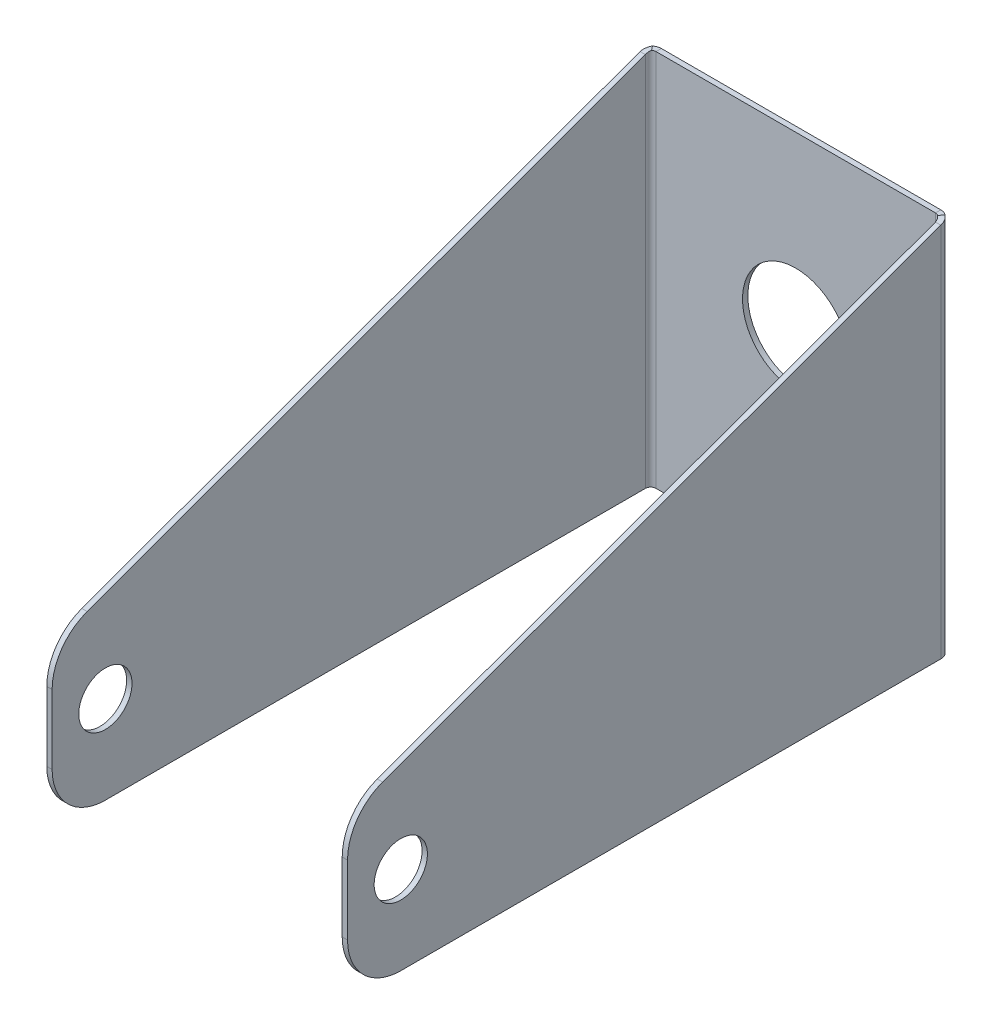
ISO-10303-21;
HEADER;
FILE_DESCRIPTION(('STEP AP214'),'2;1');
FILE_NAME('part.step','',(''),(''),'','','');
FILE_SCHEMA(('AUTOMOTIVE_DESIGN { 1 0 10303 214 1 1 1 1 }'));
ENDSEC;
DATA;
#1=APPLICATION_CONTEXT('core data for automotive mechanical design processes');
#2=APPLICATION_PROTOCOL_DEFINITION('international standard','automotive_design',2000,#1);
#3=PRODUCT_CONTEXT('',#1,'mechanical');
#4=PRODUCT('Part','Part','',(#3));
#5=PRODUCT_RELATED_PRODUCT_CATEGORY('part','',(#4));
#6=PRODUCT_DEFINITION_FORMATION('','',#4);
#7=PRODUCT_DEFINITION_CONTEXT('part definition',#1,'design');
#8=PRODUCT_DEFINITION('design','',#6,#7);
#9=PRODUCT_DEFINITION_SHAPE('','',#8);
#10=(LENGTH_UNIT() NAMED_UNIT(*) SI_UNIT(.MILLI.,.METRE.));
#11=(NAMED_UNIT(*) PLANE_ANGLE_UNIT() SI_UNIT($,.RADIAN.));
#12=(NAMED_UNIT(*) SI_UNIT($,.STERADIAN.) SOLID_ANGLE_UNIT());
#13=UNCERTAINTY_MEASURE_WITH_UNIT(LENGTH_MEASURE(1.E-05),#10,'distance_accuracy_value','');
#14=(GEOMETRIC_REPRESENTATION_CONTEXT(3) GLOBAL_UNCERTAINTY_ASSIGNED_CONTEXT((#13)) GLOBAL_UNIT_ASSIGNED_CONTEXT((#10,
#11,#12)) REPRESENTATION_CONTEXT('',''));
#15=CARTESIAN_POINT('',(0.,0.,0.));
#16=DIRECTION('',(0.,0.,1.));
#17=DIRECTION('',(1.,0.,0.));
#18=AXIS2_PLACEMENT_3D('',#15,#16,#17);
#19=CARTESIAN_POINT('',(130.,10.,1.));
#20=DIRECTION('',(0.,0.,1.));
#21=DIRECTION('',(1.,0.,0.));
#22=AXIS2_PLACEMENT_3D('',#19,#20,#21);
#23=PLANE('',#22);
#24=CARTESIAN_POINT('',(-5.19352636666497E-13,38.941410032797,1.));
#25=DIRECTION('',(0.,0.,1.));
#26=DIRECTION('',(1.,0.,0.));
#27=AXIS2_PLACEMENT_3D('',#24,#25,#26);
#28=CIRCLE('',#27,10.);
#29=CARTESIAN_POINT('',(9.99999999999949,38.941410032797,1.));
#30=VERTEX_POINT('',#29);
#31=EDGE_CURVE('E500',#30,#30,#28,.T.);
#32=ORIENTED_EDGE('',*,*,#31,.F.);
#33=EDGE_LOOP('',(#32));
#34=FACE_BOUND('',#33,.T.);
#35=DIRECTION('',(1.,0.,0.));
#36=VECTOR('',#35,1.);
#37=CARTESIAN_POINT('',(-130.,0.,1.));
#38=LINE('',#37,#36);
#39=CARTESIAN_POINT('',(-26.236885505691,0.,1.));
#40=VERTEX_POINT('',#39);
#41=CARTESIAN_POINT('',(26.23688550569,0.,1.));
#42=VERTEX_POINT('',#41);
#43=EDGE_CURVE('E514',#40,#42,#38,.T.);
#44=ORIENTED_EDGE('',*,*,#43,.T.);
#45=DIRECTION('',(0.,1.,0.));
#46=VECTOR('',#45,1.);
#47=CARTESIAN_POINT('',(26.23688550569,9.99999999999998,1.));
#48=LINE('',#47,#46);
#49=CARTESIAN_POINT('',(26.23688550569,71.0424171990802,1.));
#50=VERTEX_POINT('',#49);
#51=EDGE_CURVE('E521',#42,#50,#48,.T.);
#52=ORIENTED_EDGE('',*,*,#51,.T.);
#53=DIRECTION('',(-1.,0.,0.));
#54=VECTOR('',#53,1.);
#55=CARTESIAN_POINT('',(27.2368855056899,71.0424171990802,1.));
#56=LINE('',#55,#54);
#57=CARTESIAN_POINT('',(-26.236885505691,71.0424171990802,1.));
#58=VERTEX_POINT('',#57);
#59=EDGE_CURVE('E574',#50,#58,#56,.T.);
#60=ORIENTED_EDGE('',*,*,#59,.T.);
#61=DIRECTION('',(0.,1.,0.));
#62=VECTOR('',#61,1.);
#63=CARTESIAN_POINT('',(-26.236885505691,9.99999999999996,1.));
#64=LINE('',#63,#62);
#65=EDGE_CURVE('E511',#40,#58,#64,.T.);
#66=ORIENTED_EDGE('',*,*,#65,.F.);
#67=EDGE_LOOP('',(#44,#52,#60,#66));
#68=FACE_BOUND('',#67,.T.);
#69=ADVANCED_FACE('F56',(#34,#68),#23,.T.);
#70=CARTESIAN_POINT('',(-130.,0.,1.));
#71=DIRECTION('',(0.,1.,0.));
#72=DIRECTION('',(0.,0.,1.));
#73=AXIS2_PLACEMENT_3D('',#70,#71,#72);
#74=PLANE('',#73);
#75=DIRECTION('',(0.,0.,-1.));
#76=VECTOR('',#75,1.);
#77=CARTESIAN_POINT('',(26.23688550569,0.,1.));
#78=LINE('',#77,#76);
#79=CARTESIAN_POINT('',(26.23688550569,0.,0.));
#80=VERTEX_POINT('',#79);
#81=EDGE_CURVE('E581',#42,#80,#78,.T.);
#82=ORIENTED_EDGE('',*,*,#81,.F.);
#83=ORIENTED_EDGE('',*,*,#43,.F.);
#84=DIRECTION('',(0.,0.,-1.));
#85=VECTOR('',#84,1.);
#86=CARTESIAN_POINT('',(-26.236885505691,0.,1.));
#87=LINE('',#86,#85);
#88=CARTESIAN_POINT('',(-26.236885505691,0.,0.));
#89=VERTEX_POINT('',#88);
#90=EDGE_CURVE('E519',#40,#89,#87,.T.);
#91=ORIENTED_EDGE('',*,*,#90,.T.);
#92=DIRECTION('',(1.,0.,0.));
#93=VECTOR('',#92,1.);
#94=CARTESIAN_POINT('',(-130.,0.,0.));
#95=LINE('',#94,#93);
#96=EDGE_CURVE('E83',#89,#80,#95,.T.);
#97=ORIENTED_EDGE('',*,*,#96,.T.);
#98=EDGE_LOOP('',(#82,#83,#91,#97));
#99=FACE_BOUND('',#98,.T.);
#100=ADVANCED_FACE('F559',(#99),#74,.F.);
#101=CARTESIAN_POINT('',(27.2368855056899,71.0424171990802,1.));
#102=DIRECTION('',(0.,-1.,0.));
#103=DIRECTION('',(1.,0.,0.));
#104=AXIS2_PLACEMENT_3D('',#101,#102,#103);
#105=PLANE('',#104);
#106=DIRECTION('',(0.,0.,1.));
#107=VECTOR('',#106,1.);
#108=CARTESIAN_POINT('',(26.2368855056899,71.0424171990802,1.));
#109=LINE('',#108,#107);
#110=CARTESIAN_POINT('',(26.23688550569,71.0424171990802,0.));
#111=VERTEX_POINT('',#110);
#112=EDGE_CURVE('E12',#111,#50,#109,.T.);
#113=ORIENTED_EDGE('',*,*,#112,.F.);
#114=DIRECTION('',(-1.,0.,0.));
#115=VECTOR('',#114,1.);
#116=CARTESIAN_POINT('',(27.2368855056899,71.0424171990802,0.));
#117=LINE('',#116,#115);
#118=CARTESIAN_POINT('',(-26.236885505691,71.0424171990802,0.));
#119=VERTEX_POINT('',#118);
#120=EDGE_CURVE('E75',#111,#119,#117,.T.);
#121=ORIENTED_EDGE('',*,*,#120,.T.);
#122=DIRECTION('',(0.,0.,1.));
#123=VECTOR('',#122,1.);
#124=CARTESIAN_POINT('',(-26.236885505691,71.0424171990802,1.));
#125=LINE('',#124,#123);
#126=EDGE_CURVE('E513',#119,#58,#125,.T.);
#127=ORIENTED_EDGE('',*,*,#126,.T.);
#128=ORIENTED_EDGE('',*,*,#59,.F.);
#129=EDGE_LOOP('',(#113,#121,#127,#128));
#130=FACE_BOUND('',#129,.T.);
#131=ADVANCED_FACE('F565',(#130),#105,.F.);
#132=CARTESIAN_POINT('',(130.,10.,0.));
#133=DIRECTION('',(0.,0.,1.));
#134=DIRECTION('',(1.,0.,0.));
#135=AXIS2_PLACEMENT_3D('',#132,#133,#134);
#136=PLANE('',#135);
#137=DIRECTION('',(0.,1.,0.));
#138=VECTOR('',#137,1.);
#139=CARTESIAN_POINT('',(26.23688550569,9.99999999999998,0.));
#140=LINE('',#139,#138);
#141=EDGE_CURVE('E67',#80,#111,#140,.T.);
#142=ORIENTED_EDGE('',*,*,#141,.F.);
#143=ORIENTED_EDGE('',*,*,#96,.F.);
#144=DIRECTION('',(0.,1.,0.));
#145=VECTOR('',#144,1.);
#146=CARTESIAN_POINT('',(-26.236885505691,9.99999999999996,0.));
#147=LINE('',#146,#145);
#148=EDGE_CURVE('E517',#89,#119,#147,.T.);
#149=ORIENTED_EDGE('',*,*,#148,.T.);
#150=ORIENTED_EDGE('',*,*,#120,.F.);
#151=EDGE_LOOP('',(#142,#143,#149,#150));
#152=FACE_BOUND('',#151,.T.);
#153=CARTESIAN_POINT('',(-5.19352636666497E-13,38.941410032797,0.));
#154=DIRECTION('',(0.,0.,1.));
#155=DIRECTION('',(1.,0.,0.));
#156=AXIS2_PLACEMENT_3D('',#153,#154,#155);
#157=CIRCLE('',#156,10.);
#158=CARTESIAN_POINT('',(9.99999999999949,38.941410032797,0.));
#159=VERTEX_POINT('',#158);
#160=EDGE_CURVE('E508',#159,#159,#157,.T.);
#161=ORIENTED_EDGE('',*,*,#160,.T.);
#162=EDGE_LOOP('',(#161));
#163=FACE_BOUND('',#162,.T.);
#164=ADVANCED_FACE('F58',(#152,#163),#136,.F.);
#165=CARTESIAN_POINT('',(-5.19352636666497E-13,38.941410032797,1.));
#166=DIRECTION('',(0.,0.,-1.));
#167=DIRECTION('',(-1.,0.,0.));
#168=AXIS2_PLACEMENT_3D('',#165,#166,#167);
#169=CYLINDRICAL_SURFACE('',#168,10.);
#170=ORIENTED_EDGE('',*,*,#31,.T.);
#171=EDGE_LOOP('',(#170));
#172=FACE_BOUND('',#171,.T.);
#173=ORIENTED_EDGE('',*,*,#160,.F.);
#174=EDGE_LOOP('',(#173));
#175=FACE_BOUND('',#174,.T.);
#176=ADVANCED_FACE('F461',(#172,#175),#169,.F.);
#177=CARTESIAN_POINT('',(-26.236885505691,0.,2.));
#178=DIRECTION('',(0.,1.,0.));
#179=DIRECTION('',(-1.,0.,0.));
#180=AXIS2_PLACEMENT_3D('',#177,#178,#179);
#181=PLANE('',#180);
#182=DIRECTION('',(-1.,0.,0.));
#183=VECTOR('',#182,1.);
#184=CARTESIAN_POINT('',(-27.236885505691,0.,2.00000000000001));
#185=LINE('',#184,#183);
#186=CARTESIAN_POINT('',(-27.236885505691,0.,1.99999999999999));
#187=VERTEX_POINT('',#186);
#188=CARTESIAN_POINT('',(-28.236885505691,0.,2.00000000000001));
#189=VERTEX_POINT('',#188);
#190=EDGE_CURVE('E383',#187,#189,#185,.T.);
#191=ORIENTED_EDGE('',*,*,#190,.T.);
#192=CARTESIAN_POINT('',(-26.236885505691,0.,2.));
#193=DIRECTION('',(0.,-1.,0.));
#194=DIRECTION('',(1.,0.,0.));
#195=AXIS2_PLACEMENT_3D('',#192,#193,#194);
#196=CIRCLE('',#195,2.);
#197=EDGE_CURVE('E345',#189,#89,#196,.T.);
#198=ORIENTED_EDGE('',*,*,#197,.T.);
#199=ORIENTED_EDGE('',*,*,#90,.F.);
#200=CARTESIAN_POINT('',(-26.236885505691,0.,2.));
#201=DIRECTION('',(0.,-1.,0.));
#202=DIRECTION('',(1.,0.,0.));
#203=AXIS2_PLACEMENT_3D('',#200,#201,#202);
#204=CIRCLE('',#203,0.999999999999999);
#205=EDGE_CURVE('E387',#187,#40,#204,.T.);
#206=ORIENTED_EDGE('',*,*,#205,.F.);
#207=EDGE_LOOP('',(#191,#198,#199,#206));
#208=FACE_BOUND('',#207,.T.);
#209=ADVANCED_FACE('F460',(#208),#181,.F.);
#210=CARTESIAN_POINT('',(-26.236885505691,71.0424171990802,2.));
#211=DIRECTION('',(0.,-1.,0.));
#212=DIRECTION('',(0.,0.,-1.));
#213=AXIS2_PLACEMENT_3D('',#210,#211,#212);
#214=PLANE('',#213);
#215=ORIENTED_EDGE('',*,*,#126,.F.);
#216=CARTESIAN_POINT('',(-26.236885505691,71.0424171990802,2.));
#217=DIRECTION('',(0.,-1.,0.));
#218=DIRECTION('',(1.,0.,0.));
#219=AXIS2_PLACEMENT_3D('',#216,#217,#218);
#220=CIRCLE('',#219,2.);
#221=CARTESIAN_POINT('',(-27.4736251118305,71.0424171990802,0.428225478446108));
#222=VERTEX_POINT('',#221);
#223=EDGE_CURVE('E393',#119,#222,#220,.F.);
#224=ORIENTED_EDGE('',*,*,#223,.T.);
#225=CARTESIAN_POINT('',(-26.8552553087607,71.0424171990802,1.21411273922305));
#226=CARTESIAN_POINT('',(-27.4736251118305,71.0424171990802,0.428225478446107));
#227=B_SPLINE_CURVE_WITH_KNOTS('',1,(#225,#226),.UNSPECIFIED.,.F.,.F.,(2,2),(0.,1.),.UNSPECIFIED.);
#228=CARTESIAN_POINT('',(-26.8552553087607,71.0424171990802,1.21411273922305));
#229=VERTEX_POINT('',#228);
#230=EDGE_CURVE('E487',#222,#229,#227,.F.);
#231=ORIENTED_EDGE('',*,*,#230,.T.);
#232=CARTESIAN_POINT('',(-26.236885505691,71.0424171990802,2.));
#233=DIRECTION('',(0.,1.,0.));
#234=DIRECTION('',(0.,0.,1.));
#235=AXIS2_PLACEMENT_3D('',#232,#233,#234);
#236=CIRCLE('',#235,1.);
#237=EDGE_CURVE('E390',#58,#229,#236,.T.);
#238=ORIENTED_EDGE('',*,*,#237,.F.);
#239=EDGE_LOOP('',(#215,#224,#231,#238));
#240=FACE_BOUND('',#239,.T.);
#241=ADVANCED_FACE('F413',(#240),#214,.F.);
#242=CARTESIAN_POINT('',(-27.4736251118305,71.0424171990802,0.428225478446107));
#243=CARTESIAN_POINT('',(-27.7105426971287,70.9601239555135,0.614642395829125));
#244=CARTESIAN_POINT('',(-27.904331138654,70.8778790569783,0.855249857812818));
#245=CARTESIAN_POINT('',(-28.1676280868933,70.7133409148763,1.39745463900459));
#246=CARTESIAN_POINT('',(-28.236885505691,70.6310960163411,1.69853489536908));
#247=CARTESIAN_POINT('',(-28.236885505691,70.5488027727744,1.99999999999999));
#248=CARTESIAN_POINT('',(-26.8552553087607,71.0424171990802,1.21411273922305));
#249=CARTESIAN_POINT('',(-26.9737081089753,70.9601281184538,1.30731648281004));
#250=CARTESIAN_POINT('',(-27.0706083221725,70.8778790569783,1.42762492890641));
#251=CARTESIAN_POINT('',(-27.2022567962921,70.7133409148763,1.6987273195023));
#252=CARTESIAN_POINT('',(-27.236885505691,70.6310918534008,1.84927507274077));
#253=CARTESIAN_POINT('',(-27.236885505691,70.5488027727744,2.));
#254=B_SPLINE_SURFACE_WITH_KNOTS('',1,3,((#242,#243,#244,#245,#246,#247),(#248,#249,#250,#251,
#252,#253)),.UNSPECIFIED.,.F.,.F.,.F.,(2,2),(4,2,4),(0.,1.),(0.,0.5,1.),.UNSPECIFIED.);
#255=CARTESIAN_POINT('',(-27.4736251118305,71.0424171990802,0.428225478446107));
#256=CARTESIAN_POINT('',(-27.7105426971287,70.9601239555135,0.614642395829125));
#257=CARTESIAN_POINT('',(-27.904331138654,70.8778790569783,0.855249857812818));
#258=CARTESIAN_POINT('',(-28.1676280868933,70.7133409148763,1.39745463900459));
#259=CARTESIAN_POINT('',(-28.236885505691,70.6310960163411,1.69853489536908));
#260=CARTESIAN_POINT('',(-28.236885505691,70.5488027727744,1.99999999999999));
#261=B_SPLINE_CURVE_WITH_KNOTS('',3,(#255,#256,#257,#258,#259,#260),.UNSPECIFIED.,.F.,.F.,(4,2,
4),(0.,0.5,1.),.UNSPECIFIED.);
#262=CARTESIAN_POINT('',(-28.236885505691,70.5488027727744,2.00000000000001));
#263=VERTEX_POINT('',#262);
#264=EDGE_CURVE('E391',#222,#263,#261,.T.);
#265=CARTESIAN_POINT('',(-28.236885505691,70.5488027727744,1.99999999999999));
#266=CARTESIAN_POINT('',(-27.236885505691,70.5488027727744,2.));
#267=B_SPLINE_CURVE_WITH_KNOTS('',1,(#265,#266),.UNSPECIFIED.,.F.,.F.,(2,2),(0.,1.),.UNSPECIFIED.);
#268=CARTESIAN_POINT('',(-27.236885505691,70.5488027727744,2.00000000000001));
#269=VERTEX_POINT('',#268);
#270=EDGE_CURVE('E382',#263,#269,#267,.T.);
#271=CARTESIAN_POINT('',(-27.236885505691,70.5488027727744,2.));
#272=CARTESIAN_POINT('',(-27.236885505691,70.6310918534008,1.84927507274077));
#273=CARTESIAN_POINT('',(-27.2022567962921,70.7133409148763,1.6987273195023));
#274=CARTESIAN_POINT('',(-27.0706083221725,70.8778790569783,1.42762492890641));
#275=CARTESIAN_POINT('',(-26.9737081089753,70.9601281184538,1.30731648281004));
#276=CARTESIAN_POINT('',(-26.8552553087607,71.0424171990802,1.21411273922305));
#277=B_SPLINE_CURVE_WITH_KNOTS('',3,(#271,#272,#273,#274,#275,#276),.UNSPECIFIED.,.F.,.F.,(4,2,
4),(0.,0.5,1.),.UNSPECIFIED.);
#278=EDGE_CURVE('E443',#229,#269,#277,.F.);
#279=ORIENTED_EDGE('',*,*,#264,.T.);
#280=ORIENTED_EDGE('',*,*,#270,.T.);
#281=ORIENTED_EDGE('',*,*,#278,.F.);
#282=ORIENTED_EDGE('',*,*,#230,.F.);
#283=EDGE_LOOP('',(#279,#280,#281,#282));
#284=FACE_BOUND('',#283,.T.);
#285=ADVANCED_FACE('F411',(#284),#254,.F.);
#286=CARTESIAN_POINT('',(-26.236885505691,106.609721693878,2.));
#287=DIRECTION('',(0.,-1.,0.));
#288=DIRECTION('',(1.,0.,0.));
#289=AXIS2_PLACEMENT_3D('',#286,#287,#288);
#290=CYLINDRICAL_SURFACE('',#289,1.);
#291=ORIENTED_EDGE('',*,*,#237,.T.);
#292=ORIENTED_EDGE('',*,*,#278,.T.);
#293=DIRECTION('',(0.,1.,0.));
#294=VECTOR('',#293,1.);
#295=CARTESIAN_POINT('',(-27.236885505691,9.99999999999996,1.99999999999999));
#296=LINE('',#295,#294);
#297=EDGE_CURVE('E363',#187,#269,#296,.T.);
#298=ORIENTED_EDGE('',*,*,#297,.F.);
#299=ORIENTED_EDGE('',*,*,#205,.T.);
#300=ORIENTED_EDGE('',*,*,#65,.T.);
#301=EDGE_LOOP('',(#291,#292,#298,#299,#300));
#302=FACE_BOUND('',#301,.T.);
#303=ADVANCED_FACE('F400',(#302),#290,.F.);
#304=CARTESIAN_POINT('',(-26.236885505691,106.609721693878,2.));
#305=DIRECTION('',(0.,-1.,0.));
#306=DIRECTION('',(1.,0.,0.));
#307=AXIS2_PLACEMENT_3D('',#304,#305,#306);
#308=CYLINDRICAL_SURFACE('',#307,2.);
#309=ORIENTED_EDGE('',*,*,#223,.F.);
#310=ORIENTED_EDGE('',*,*,#148,.F.);
#311=ORIENTED_EDGE('',*,*,#197,.F.);
#312=DIRECTION('',(0.,1.,0.));
#313=VECTOR('',#312,1.);
#314=CARTESIAN_POINT('',(-28.236885505691,9.99999999999996,1.99999999999999));
#315=LINE('',#314,#313);
#316=EDGE_CURVE('E386',#189,#263,#315,.T.);
#317=ORIENTED_EDGE('',*,*,#316,.T.);
#318=ORIENTED_EDGE('',*,*,#264,.F.);
#319=EDGE_LOOP('',(#309,#310,#311,#317,#318));
#320=FACE_BOUND('',#319,.T.);
#321=ADVANCED_FACE('F410',(#320),#308,.T.);
#322=CARTESIAN_POINT('',(-27.2368855056906,10.,103.406920004117));
#323=DIRECTION('',(-1.,0.,0.));
#324=DIRECTION('',(0.,0.,1.));
#325=AXIS2_PLACEMENT_3D('',#322,#323,#324);
#326=CYLINDRICAL_SURFACE('',#325,10.);
#327=CARTESIAN_POINT('',(-28.2368855056906,10.,103.406920004117));
#328=DIRECTION('',(1.,0.,0.));
#329=DIRECTION('',(0.,0.,-1.));
#330=AXIS2_PLACEMENT_3D('',#327,#328,#329);
#331=CIRCLE('',#330,10.);
#332=CARTESIAN_POINT('',(-28.2368855056906,10.,113.406920004117));
#333=VERTEX_POINT('',#332);
#334=CARTESIAN_POINT('',(-28.2368855056906,0.,103.406920004117));
#335=VERTEX_POINT('',#334);
#336=EDGE_CURVE('E380',#333,#335,#331,.T.);
#337=ORIENTED_EDGE('',*,*,#336,.T.);
#338=DIRECTION('',(-1.,0.,0.));
#339=VECTOR('',#338,1.);
#340=CARTESIAN_POINT('',(-27.2368855056906,0.,103.406920004117));
#341=LINE('',#340,#339);
#342=CARTESIAN_POINT('',(-27.2368855056906,0.,103.406920004117));
#343=VERTEX_POINT('',#342);
#344=EDGE_CURVE('E346',#343,#335,#341,.T.);
#345=ORIENTED_EDGE('',*,*,#344,.F.);
#346=CARTESIAN_POINT('',(-27.2368855056906,10.,103.406920004117));
#347=DIRECTION('',(1.,0.,0.));
#348=DIRECTION('',(0.,0.,-1.));
#349=AXIS2_PLACEMENT_3D('',#346,#347,#348);
#350=CIRCLE('',#349,10.);
#351=CARTESIAN_POINT('',(-27.2368855056906,10.,113.406920004117));
#352=VERTEX_POINT('',#351);
#353=EDGE_CURVE('E353',#352,#343,#350,.T.);
#354=ORIENTED_EDGE('',*,*,#353,.F.);
#355=DIRECTION('',(-1.,0.,0.));
#356=VECTOR('',#355,1.);
#357=CARTESIAN_POINT('',(-27.2368855056906,10.,113.406920004117));
#358=LINE('',#357,#356);
#359=EDGE_CURVE('E377',#352,#333,#358,.T.);
#360=ORIENTED_EDGE('',*,*,#359,.T.);
#361=EDGE_LOOP('',(#337,#345,#354,#360));
#362=FACE_BOUND('',#361,.T.);
#363=ADVANCED_FACE('F419',(#362),#326,.T.);
#364=CARTESIAN_POINT('',(-27.2368855056906,22.9979246179029,113.406920004117));
#365=DIRECTION('',(0.,0.,-1.));
#366=DIRECTION('',(-1.,0.,0.));
#367=AXIS2_PLACEMENT_3D('',#364,#365,#366);
#368=PLANE('',#367);
#369=DIRECTION('',(0.,-1.,0.));
#370=VECTOR('',#369,1.);
#371=CARTESIAN_POINT('',(-28.2368855056906,22.9979246179029,113.406920004117));
#372=LINE('',#371,#370);
#373=CARTESIAN_POINT('',(-28.2368855056906,22.9979246179029,113.406920004117));
#374=VERTEX_POINT('',#373);
#375=EDGE_CURVE('E375',#374,#333,#372,.T.);
#376=ORIENTED_EDGE('',*,*,#375,.T.);
#377=ORIENTED_EDGE('',*,*,#359,.F.);
#378=DIRECTION('',(0.,-1.,0.));
#379=VECTOR('',#378,1.);
#380=CARTESIAN_POINT('',(-27.2368855056906,22.9979246179029,113.406920004117));
#381=LINE('',#380,#379);
#382=CARTESIAN_POINT('',(-27.2368855056906,22.9979246179029,113.406920004117));
#383=VERTEX_POINT('',#382);
#384=EDGE_CURVE('E355',#383,#352,#381,.T.);
#385=ORIENTED_EDGE('',*,*,#384,.F.);
#386=DIRECTION('',(-1.,0.,0.));
#387=VECTOR('',#386,1.);
#388=CARTESIAN_POINT('',(-27.2368855056906,22.9979246179029,113.406920004117));
#389=LINE('',#388,#387);
#390=EDGE_CURVE('E372',#383,#374,#389,.T.);
#391=ORIENTED_EDGE('',*,*,#390,.T.);
#392=EDGE_LOOP('',(#376,#377,#385,#391));
#393=FACE_BOUND('',#392,.T.);
#394=ADVANCED_FACE('F658',(#393),#368,.F.);
#395=CARTESIAN_POINT('',(-27.2368855056906,22.9979246179029,103.406920004117));
#396=DIRECTION('',(-1.,0.,0.));
#397=DIRECTION('',(0.,0.,1.));
#398=AXIS2_PLACEMENT_3D('',#395,#396,#397);
#399=CYLINDRICAL_SURFACE('',#398,10.);
#400=CARTESIAN_POINT('',(-28.2368855056906,22.9979246179029,103.406920004117));
#401=DIRECTION('',(1.,0.,0.));
#402=DIRECTION('',(0.,0.,-1.));
#403=AXIS2_PLACEMENT_3D('',#400,#401,#402);
#404=CIRCLE('',#403,10.);
#405=CARTESIAN_POINT('',(-28.2368855056906,32.394850825762,106.827121437373));
#406=VERTEX_POINT('',#405);
#407=EDGE_CURVE('E370',#406,#374,#404,.T.);
#408=ORIENTED_EDGE('',*,*,#407,.T.);
#409=ORIENTED_EDGE('',*,*,#390,.F.);
#410=CARTESIAN_POINT('',(-27.2368855056906,22.9979246179029,103.406920004117));
#411=DIRECTION('',(1.,0.,0.));
#412=DIRECTION('',(0.,0.,-1.));
#413=AXIS2_PLACEMENT_3D('',#410,#411,#412);
#414=CIRCLE('',#413,10.);
#415=CARTESIAN_POINT('',(-27.2368855056906,32.394850825762,106.827121437373));
#416=VERTEX_POINT('',#415);
#417=EDGE_CURVE('E357',#416,#383,#414,.T.);
#418=ORIENTED_EDGE('',*,*,#417,.F.);
#419=DIRECTION('',(-1.,0.,0.));
#420=VECTOR('',#419,1.);
#421=CARTESIAN_POINT('',(-27.2368855056906,32.394850825762,106.827121437373));
#422=LINE('',#421,#420);
#423=EDGE_CURVE('E367',#416,#406,#422,.T.);
#424=ORIENTED_EDGE('',*,*,#423,.T.);
#425=EDGE_LOOP('',(#408,#409,#418,#424));
#426=FACE_BOUND('',#425,.T.);
#427=ADVANCED_FACE('F651',(#426),#399,.T.);
#428=CARTESIAN_POINT('',(-27.2368855056906,16.5,103.406920004117));
#429=DIRECTION('',(-1.,0.,0.));
#430=DIRECTION('',(0.,0.,1.));
#431=AXIS2_PLACEMENT_3D('',#428,#429,#430);
#432=CYLINDRICAL_SURFACE('',#431,4.99999999999999);
#433=CARTESIAN_POINT('',(-27.2368855056906,16.5,103.406920004117));
#434=DIRECTION('',(1.,0.,0.));
#435=DIRECTION('',(0.,0.,-1.));
#436=AXIS2_PLACEMENT_3D('',#433,#434,#435);
#437=CIRCLE('',#436,4.99999999999999);
#438=CARTESIAN_POINT('',(-27.2368855056906,16.5,98.4069200041167));
#439=VERTEX_POINT('',#438);
#440=EDGE_CURVE('E364',#439,#439,#437,.T.);
#441=ORIENTED_EDGE('',*,*,#440,.T.);
#442=EDGE_LOOP('',(#441));
#443=FACE_BOUND('',#442,.T.);
#444=CARTESIAN_POINT('',(-28.2368855056906,16.5,103.406920004117));
#445=DIRECTION('',(1.,0.,0.));
#446=DIRECTION('',(0.,0.,-1.));
#447=AXIS2_PLACEMENT_3D('',#444,#445,#446);
#448=CIRCLE('',#447,4.99999999999999);
#449=CARTESIAN_POINT('',(-28.2368855056906,16.5,98.4069200041167));
#450=VERTEX_POINT('',#449);
#451=EDGE_CURVE('E349',#450,#450,#448,.T.);
#452=ORIENTED_EDGE('',*,*,#451,.F.);
#453=EDGE_LOOP('',(#452));
#454=FACE_BOUND('',#453,.T.);
#455=ADVANCED_FACE('F711',(#443,#454),#432,.F.);
#456=CARTESIAN_POINT('',(-27.2368855056915,9.99999999999996,-156.593079995883));
#457=DIRECTION('',(1.,0.,0.));
#458=DIRECTION('',(0.,0.,-1.));
#459=AXIS2_PLACEMENT_3D('',#456,#457,#458);
#460=PLANE('',#459);
#461=ORIENTED_EDGE('',*,*,#440,.F.);
#462=EDGE_LOOP('',(#461));
#463=FACE_BOUND('',#462,.T.);
#464=DIRECTION('',(0.,0.,-1.));
#465=VECTOR('',#464,1.);
#466=CARTESIAN_POINT('',(-27.2368855056906,0.,103.406920004117));
#467=LINE('',#466,#465);
#468=EDGE_CURVE('E360',#343,#187,#467,.T.);
#469=ORIENTED_EDGE('',*,*,#468,.T.);
#470=ORIENTED_EDGE('',*,*,#297,.T.);
#471=DIRECTION('',(0.,-0.342020143325668,0.939692620785909));
#472=VECTOR('',#471,1.);
#473=CARTESIAN_POINT('',(-27.236885505691,71.0424171990802,0.643805509807655));
#474=LINE('',#473,#472);
#475=EDGE_CURVE('E359',#269,#416,#474,.T.);
#476=ORIENTED_EDGE('',*,*,#475,.T.);
#477=ORIENTED_EDGE('',*,*,#417,.T.);
#478=ORIENTED_EDGE('',*,*,#384,.T.);
#479=ORIENTED_EDGE('',*,*,#353,.T.);
#480=EDGE_LOOP('',(#469,#470,#476,#477,#478,#479));
#481=FACE_BOUND('',#480,.T.);
#482=ADVANCED_FACE('F548',(#463,#481),#460,.T.);
#483=CARTESIAN_POINT('',(-27.236885505691,71.0424171990802,0.643805509807655));
#484=DIRECTION('',(0.,-0.939692620785909,-0.342020143325668));
#485=DIRECTION('',(0.,0.342020143325668,-0.939692620785909));
#486=AXIS2_PLACEMENT_3D('',#483,#484,#485);
#487=PLANE('',#486);
#488=ORIENTED_EDGE('',*,*,#270,.F.);
#489=DIRECTION('',(0.,-0.342020143325668,0.939692620785909));
#490=VECTOR('',#489,1.);
#491=CARTESIAN_POINT('',(-28.236885505691,71.0424171990802,0.643805509807659));
#492=LINE('',#491,#490);
#493=EDGE_CURVE('E352',#263,#406,#492,.T.);
#494=ORIENTED_EDGE('',*,*,#493,.T.);
#495=ORIENTED_EDGE('',*,*,#423,.F.);
#496=ORIENTED_EDGE('',*,*,#475,.F.);
#497=EDGE_LOOP('',(#488,#494,#495,#496));
#498=FACE_BOUND('',#497,.T.);
#499=ADVANCED_FACE('F538',(#498),#487,.F.);
#500=CARTESIAN_POINT('',(-28.2368855056915,9.99999999999996,-156.593079995883));
#501=DIRECTION('',(1.,0.,0.));
#502=DIRECTION('',(0.,0.,-1.));
#503=AXIS2_PLACEMENT_3D('',#500,#501,#502);
#504=PLANE('',#503);
#505=ORIENTED_EDGE('',*,*,#316,.F.);
#506=DIRECTION('',(0.,0.,-1.));
#507=VECTOR('',#506,1.);
#508=CARTESIAN_POINT('',(-28.2368855056906,0.,103.406920004117));
#509=LINE('',#508,#507);
#510=EDGE_CURVE('E338',#335,#189,#509,.T.);
#511=ORIENTED_EDGE('',*,*,#510,.F.);
#512=ORIENTED_EDGE('',*,*,#336,.F.);
#513=ORIENTED_EDGE('',*,*,#375,.F.);
#514=ORIENTED_EDGE('',*,*,#407,.F.);
#515=ORIENTED_EDGE('',*,*,#493,.F.);
#516=EDGE_LOOP('',(#505,#511,#512,#513,#514,#515));
#517=FACE_BOUND('',#516,.T.);
#518=ORIENTED_EDGE('',*,*,#451,.T.);
#519=EDGE_LOOP('',(#518));
#520=FACE_BOUND('',#519,.T.);
#521=ADVANCED_FACE('F547',(#517,#520),#504,.F.);
#522=CARTESIAN_POINT('',(-27.2368855056906,0.,103.406920004117));
#523=DIRECTION('',(0.,1.,0.));
#524=DIRECTION('',(1.,0.,0.));
#525=AXIS2_PLACEMENT_3D('',#522,#523,#524);
#526=PLANE('',#525);
#527=ORIENTED_EDGE('',*,*,#190,.F.);
#528=ORIENTED_EDGE('',*,*,#468,.F.);
#529=ORIENTED_EDGE('',*,*,#344,.T.);
#530=ORIENTED_EDGE('',*,*,#510,.T.);
#531=EDGE_LOOP('',(#527,#528,#529,#530));
#532=FACE_BOUND('',#531,.T.);
#533=ADVANCED_FACE('F414',(#532),#526,.F.);
#534=CARTESIAN_POINT('',(26.23688550569,0.,2.));
#535=DIRECTION('',(0.,1.,0.));
#536=DIRECTION('',(-1.,0.,0.));
#537=AXIS2_PLACEMENT_3D('',#534,#535,#536);
#538=PLANE('',#537);
#539=ORIENTED_EDGE('',*,*,#81,.T.);
#540=CARTESIAN_POINT('',(26.23688550569,0.,2.));
#541=DIRECTION('',(0.,1.,0.));
#542=DIRECTION('',(-1.,0.,0.));
#543=AXIS2_PLACEMENT_3D('',#540,#541,#542);
#544=CIRCLE('',#543,2.);
#545=CARTESIAN_POINT('',(28.23688550569,0.,1.99999999999997));
#546=VERTEX_POINT('',#545);
#547=EDGE_CURVE('E228',#80,#546,#544,.F.);
#548=ORIENTED_EDGE('',*,*,#547,.T.);
#549=DIRECTION('',(1.,0.,0.));
#550=VECTOR('',#549,1.);
#551=CARTESIAN_POINT('',(27.23688550569,0.,1.99999999999996));
#552=LINE('',#551,#550);
#553=CARTESIAN_POINT('',(27.23688550569,0.,1.99999999999996));
#554=VERTEX_POINT('',#553);
#555=EDGE_CURVE('E593',#554,#546,#552,.T.);
#556=ORIENTED_EDGE('',*,*,#555,.F.);
#557=CARTESIAN_POINT('',(26.23688550569,0.,2.));
#558=DIRECTION('',(0.,-1.,0.));
#559=DIRECTION('',(1.,0.,0.));
#560=AXIS2_PLACEMENT_3D('',#557,#558,#559);
#561=CIRCLE('',#560,0.999999999999999);
#562=EDGE_CURVE('E223',#42,#554,#561,.T.);
#563=ORIENTED_EDGE('',*,*,#562,.F.);
#564=EDGE_LOOP('',(#539,#548,#556,#563));
#565=FACE_BOUND('',#564,.T.);
#566=ADVANCED_FACE('F298',(#565),#538,.F.);
#567=CARTESIAN_POINT('',(28.23688550569,70.5488027727744,2.00000000000002));
#568=CARTESIAN_POINT('',(28.23688550569,70.6310960163411,1.6985348953691));
#569=CARTESIAN_POINT('',(28.1676280868923,70.7133409148763,1.3974546390046));
#570=CARTESIAN_POINT('',(27.9043311386529,70.8778790569783,0.855249857812812));
#571=CARTESIAN_POINT('',(27.7105426971277,70.9601239555135,0.614642395829118));
#572=CARTESIAN_POINT('',(27.4736251118294,71.0424171990802,0.428225478446095));
#573=CARTESIAN_POINT('',(27.23688550569,70.5488027727744,2.00000000000001));
#574=CARTESIAN_POINT('',(27.23688550569,70.6310918534008,1.84927507274077));
#575=CARTESIAN_POINT('',(27.2022567962911,70.7133409148763,1.6987273195023));
#576=CARTESIAN_POINT('',(27.0706083221714,70.8778790569783,1.42762492890641));
#577=CARTESIAN_POINT('',(26.9737081089743,70.9601281184538,1.30731648281004));
#578=CARTESIAN_POINT('',(26.8552553087597,71.0424171990802,1.21411273922305));
#579=B_SPLINE_SURFACE_WITH_KNOTS('',1,3,((#567,#568,#569,#570,#571,#572),(#573,#574,#575,#576,
#577,#578)),.UNSPECIFIED.,.F.,.F.,.F.,(2,2),(4,2,4),(0.,1.),(0.,0.5,1.),.UNSPECIFIED.);
#580=CARTESIAN_POINT('',(27.23688550569,70.5488027727744,2.00000000000001));
#581=CARTESIAN_POINT('',(28.23688550569,70.5488027727744,2.00000000000002));
#582=B_SPLINE_CURVE_WITH_KNOTS('',1,(#580,#581),.UNSPECIFIED.,.F.,.F.,(2,2),(0.,1.),.UNSPECIFIED.);
#583=CARTESIAN_POINT('',(28.23688550569,70.5488027727744,2.00000000000001));
#584=VERTEX_POINT('',#583);
#585=CARTESIAN_POINT('',(27.23688550569,70.5488027727744,2.00000000000001));
#586=VERTEX_POINT('',#585);
#587=EDGE_CURVE('E334',#584,#586,#582,.F.);
#588=CARTESIAN_POINT('',(28.23688550569,70.5488027727744,2.00000000000002));
#589=CARTESIAN_POINT('',(28.23688550569,70.6310960163411,1.6985348953691));
#590=CARTESIAN_POINT('',(28.1676280868923,70.7133409148763,1.3974546390046));
#591=CARTESIAN_POINT('',(27.9043311386529,70.8778790569783,0.855249857812812));
#592=CARTESIAN_POINT('',(27.7105426971277,70.9601239555135,0.614642395829118));
#593=CARTESIAN_POINT('',(27.4736251118294,71.0424171990802,0.428225478446095));
#594=B_SPLINE_CURVE_WITH_KNOTS('',3,(#588,#589,#590,#591,#592,#593),.UNSPECIFIED.,.F.,.F.,(4,2,
4),(0.,0.5,1.),.UNSPECIFIED.);
#595=CARTESIAN_POINT('',(27.4736251118294,71.0424171990802,0.428225478446095));
#596=VERTEX_POINT('',#595);
#597=EDGE_CURVE('E231',#584,#596,#594,.T.);
#598=CARTESIAN_POINT('',(27.4736251118294,71.0424171990802,0.428225478446095));
#599=CARTESIAN_POINT('',(26.8552553087597,71.0424171990802,1.21411273922305));
#600=B_SPLINE_CURVE_WITH_KNOTS('',1,(#598,#599),.UNSPECIFIED.,.F.,.F.,(2,2),(0.,1.),.UNSPECIFIED.);
#601=CARTESIAN_POINT('',(26.8552553087597,71.0424171990802,1.21411273922305));
#602=VERTEX_POINT('',#601);
#603=EDGE_CURVE('E324',#596,#602,#600,.T.);
#604=CARTESIAN_POINT('',(26.8552553087597,71.0424171990802,1.21411273922305));
#605=CARTESIAN_POINT('',(26.9737081089743,70.9601281184538,1.30731648281004));
#606=CARTESIAN_POINT('',(27.0706083221714,70.8778790569783,1.42762492890641));
#607=CARTESIAN_POINT('',(27.2022567962911,70.7133409148763,1.6987273195023));
#608=CARTESIAN_POINT('',(27.23688550569,70.6310918534008,1.84927507274077));
#609=CARTESIAN_POINT('',(27.23688550569,70.5488027727744,2.00000000000001));
#610=B_SPLINE_CURVE_WITH_KNOTS('',3,(#604,#605,#606,#607,#608,#609),.UNSPECIFIED.,.F.,.F.,(4,2,
4),(0.,0.5,1.),.UNSPECIFIED.);
#611=EDGE_CURVE('E226',#586,#602,#610,.F.);
#612=ORIENTED_EDGE('',*,*,#587,.F.);
#613=ORIENTED_EDGE('',*,*,#597,.T.);
#614=ORIENTED_EDGE('',*,*,#603,.T.);
#615=ORIENTED_EDGE('',*,*,#611,.F.);
#616=EDGE_LOOP('',(#612,#613,#614,#615));
#617=FACE_BOUND('',#616,.T.);
#618=ADVANCED_FACE('F287',(#617),#579,.F.);
#619=CARTESIAN_POINT('',(26.23688550569,71.0424171990802,2.));
#620=DIRECTION('',(0.,-1.,0.));
#621=DIRECTION('',(0.,0.,-1.));
#622=AXIS2_PLACEMENT_3D('',#619,#620,#621);
#623=PLANE('',#622);
#624=ORIENTED_EDGE('',*,*,#603,.F.);
#625=CARTESIAN_POINT('',(26.23688550569,71.0424171990802,2.));
#626=DIRECTION('',(0.,1.,0.));
#627=DIRECTION('',(-1.,0.,0.));
#628=AXIS2_PLACEMENT_3D('',#625,#626,#627);
#629=CIRCLE('',#628,2.);
#630=EDGE_CURVE('E227',#596,#111,#629,.T.);
#631=ORIENTED_EDGE('',*,*,#630,.T.);
#632=ORIENTED_EDGE('',*,*,#112,.T.);
#633=CARTESIAN_POINT('',(26.23688550569,71.0424171990802,2.));
#634=DIRECTION('',(0.,1.,0.));
#635=DIRECTION('',(0.,0.,1.));
#636=AXIS2_PLACEMENT_3D('',#633,#634,#635);
#637=CIRCLE('',#636,1.);
#638=EDGE_CURVE('E241',#602,#50,#637,.T.);
#639=ORIENTED_EDGE('',*,*,#638,.F.);
#640=EDGE_LOOP('',(#624,#631,#632,#639));
#641=FACE_BOUND('',#640,.T.);
#642=ADVANCED_FACE('F254',(#641),#623,.F.);
#643=CARTESIAN_POINT('',(26.23688550569,-35.5673044947973,2.));
#644=DIRECTION('',(0.,1.,0.));
#645=DIRECTION('',(-1.,0.,0.));
#646=AXIS2_PLACEMENT_3D('',#643,#644,#645);
#647=CYLINDRICAL_SURFACE('',#646,1.);
#648=ORIENTED_EDGE('',*,*,#638,.T.);
#649=ORIENTED_EDGE('',*,*,#51,.F.);
#650=ORIENTED_EDGE('',*,*,#562,.T.);
#651=DIRECTION('',(0.,1.,0.));
#652=VECTOR('',#651,1.);
#653=CARTESIAN_POINT('',(27.23688550569,9.99999999999999,1.99999999999998));
#654=LINE('',#653,#652);
#655=EDGE_CURVE('E222',#554,#586,#654,.T.);
#656=ORIENTED_EDGE('',*,*,#655,.T.);
#657=ORIENTED_EDGE('',*,*,#611,.T.);
#658=EDGE_LOOP('',(#648,#649,#650,#656,#657));
#659=FACE_BOUND('',#658,.T.);
#660=ADVANCED_FACE('F244',(#659),#647,.F.);
#661=CARTESIAN_POINT('',(26.23688550569,-35.5673044947973,2.));
#662=DIRECTION('',(0.,1.,0.));
#663=DIRECTION('',(-1.,0.,0.));
#664=AXIS2_PLACEMENT_3D('',#661,#662,#663);
#665=CYLINDRICAL_SURFACE('',#664,2.);
#666=ORIENTED_EDGE('',*,*,#630,.F.);
#667=ORIENTED_EDGE('',*,*,#597,.F.);
#668=DIRECTION('',(0.,1.,0.));
#669=VECTOR('',#668,1.);
#670=CARTESIAN_POINT('',(28.23688550569,9.99999999999999,1.99999999999998));
#671=LINE('',#670,#669);
#672=EDGE_CURVE('E603',#546,#584,#671,.T.);
#673=ORIENTED_EDGE('',*,*,#672,.F.);
#674=ORIENTED_EDGE('',*,*,#547,.F.);
#675=ORIENTED_EDGE('',*,*,#141,.T.);
#676=EDGE_LOOP('',(#666,#667,#673,#674,#675));
#677=FACE_BOUND('',#676,.T.);
#678=ADVANCED_FACE('F253',(#677),#665,.T.);
#679=CARTESIAN_POINT('',(27.2368855056896,16.5,103.406920004117));
#680=DIRECTION('',(1.,0.,0.));
#681=DIRECTION('',(0.,0.,-1.));
#682=AXIS2_PLACEMENT_3D('',#679,#680,#681);
#683=CYLINDRICAL_SURFACE('',#682,4.99999999999999);
#684=CARTESIAN_POINT('',(27.2368855056896,16.5,103.406920004117));
#685=DIRECTION('',(-1.,0.,0.));
#686=DIRECTION('',(0.,0.,-1.));
#687=AXIS2_PLACEMENT_3D('',#684,#685,#686);
#688=CIRCLE('',#687,4.99999999999999);
#689=CARTESIAN_POINT('',(27.2368855056896,16.5,98.4069200041169));
#690=VERTEX_POINT('',#689);
#691=EDGE_CURVE('E219',#690,#690,#688,.T.);
#692=ORIENTED_EDGE('',*,*,#691,.T.);
#693=EDGE_LOOP('',(#692));
#694=FACE_BOUND('',#693,.T.);
#695=CARTESIAN_POINT('',(28.2368855056896,16.5,103.406920004117));
#696=DIRECTION('',(-1.,0.,0.));
#697=DIRECTION('',(0.,0.,-1.));
#698=AXIS2_PLACEMENT_3D('',#695,#696,#697);
#699=CIRCLE('',#698,4.99999999999999);
#700=CARTESIAN_POINT('',(28.2368855056896,16.5,98.4069200041169));
#701=VERTEX_POINT('',#700);
#702=EDGE_CURVE('E608',#701,#701,#699,.T.);
#703=ORIENTED_EDGE('',*,*,#702,.F.);
#704=EDGE_LOOP('',(#703));
#705=FACE_BOUND('',#704,.T.);
#706=ADVANCED_FACE('F262',(#694,#705),#683,.F.);
#707=CARTESIAN_POINT('',(27.2368855056896,22.9979246179029,103.406920004118));
#708=DIRECTION('',(1.,0.,0.));
#709=DIRECTION('',(0.,0.,-1.));
#710=AXIS2_PLACEMENT_3D('',#707,#708,#709);
#711=CYLINDRICAL_SURFACE('',#710,10.);
#712=CARTESIAN_POINT('',(28.2368855056896,22.9979246179029,103.406920004118));
#713=DIRECTION('',(-1.,0.,0.));
#714=DIRECTION('',(0.,0.,1.));
#715=AXIS2_PLACEMENT_3D('',#712,#713,#714);
#716=CIRCLE('',#715,10.);
#717=CARTESIAN_POINT('',(28.2368855056896,22.9979246179029,113.406920004118));
#718=VERTEX_POINT('',#717);
#719=CARTESIAN_POINT('',(28.2368855056896,32.394850825762,106.827121437374));
#720=VERTEX_POINT('',#719);
#721=EDGE_CURVE('E194',#718,#720,#716,.T.);
#722=ORIENTED_EDGE('',*,*,#721,.T.);
#723=DIRECTION('',(1.,0.,0.));
#724=VECTOR('',#723,1.);
#725=CARTESIAN_POINT('',(27.2368855056896,32.394850825762,106.827121437374));
#726=LINE('',#725,#724);
#727=CARTESIAN_POINT('',(27.2368855056896,32.394850825762,106.827121437374));
#728=VERTEX_POINT('',#727);
#729=EDGE_CURVE('E232',#728,#720,#726,.T.);
#730=ORIENTED_EDGE('',*,*,#729,.F.);
#731=CARTESIAN_POINT('',(27.2368855056896,22.9979246179029,103.406920004118));
#732=DIRECTION('',(-1.,0.,0.));
#733=DIRECTION('',(0.,0.,1.));
#734=AXIS2_PLACEMENT_3D('',#731,#732,#733);
#735=CIRCLE('',#734,10.);
#736=CARTESIAN_POINT('',(27.2368855056896,22.9979246179029,113.406920004118));
#737=VERTEX_POINT('',#736);
#738=EDGE_CURVE('E594',#737,#728,#735,.T.);
#739=ORIENTED_EDGE('',*,*,#738,.F.);
#740=DIRECTION('',(1.,0.,0.));
#741=VECTOR('',#740,1.);
#742=CARTESIAN_POINT('',(27.2368855056896,22.9979246179029,113.406920004118));
#743=LINE('',#742,#741);
#744=EDGE_CURVE('E199',#737,#718,#743,.T.);
#745=ORIENTED_EDGE('',*,*,#744,.T.);
#746=EDGE_LOOP('',(#722,#730,#739,#745));
#747=FACE_BOUND('',#746,.T.);
#748=ADVANCED_FACE('F788',(#747),#711,.T.);
#749=CARTESIAN_POINT('',(27.2368855056896,9.99999999999998,113.406920004118));
#750=DIRECTION('',(0.,0.,-1.));
#751=DIRECTION('',(-1.,0.,0.));
#752=AXIS2_PLACEMENT_3D('',#749,#750,#751);
#753=PLANE('',#752);
#754=DIRECTION('',(0.,1.,0.));
#755=VECTOR('',#754,1.);
#756=CARTESIAN_POINT('',(28.2368855056896,9.99999999999998,113.406920004118));
#757=LINE('',#756,#755);
#758=CARTESIAN_POINT('',(28.2368855056896,9.99999999999998,113.406920004118));
#759=VERTEX_POINT('',#758);
#760=EDGE_CURVE('E188',#759,#718,#757,.T.);
#761=ORIENTED_EDGE('',*,*,#760,.T.);
#762=ORIENTED_EDGE('',*,*,#744,.F.);
#763=DIRECTION('',(0.,1.,0.));
#764=VECTOR('',#763,1.);
#765=CARTESIAN_POINT('',(27.2368855056896,9.99999999999998,113.406920004118));
#766=LINE('',#765,#764);
#767=CARTESIAN_POINT('',(27.2368855056896,9.99999999999998,113.406920004118));
#768=VERTEX_POINT('',#767);
#769=EDGE_CURVE('E203',#768,#737,#766,.T.);
#770=ORIENTED_EDGE('',*,*,#769,.F.);
#771=DIRECTION('',(1.,0.,0.));
#772=VECTOR('',#771,1.);
#773=CARTESIAN_POINT('',(27.2368855056896,9.99999999999998,113.406920004118));
#774=LINE('',#773,#772);
#775=EDGE_CURVE('E198',#768,#759,#774,.T.);
#776=ORIENTED_EDGE('',*,*,#775,.T.);
#777=EDGE_LOOP('',(#761,#762,#770,#776));
#778=FACE_BOUND('',#777,.T.);
#779=ADVANCED_FACE('F202',(#778),#753,.F.);
#780=CARTESIAN_POINT('',(27.2368855056896,9.99999999999998,103.406920004118));
#781=DIRECTION('',(1.,0.,0.));
#782=DIRECTION('',(0.,0.,-1.));
#783=AXIS2_PLACEMENT_3D('',#780,#781,#782);
#784=CYLINDRICAL_SURFACE('',#783,10.);
#785=CARTESIAN_POINT('',(28.2368855056896,9.99999999999998,103.406920004118));
#786=DIRECTION('',(-1.,0.,0.));
#787=DIRECTION('',(0.,0.,1.));
#788=AXIS2_PLACEMENT_3D('',#785,#786,#787);
#789=CIRCLE('',#788,10.);
#790=CARTESIAN_POINT('',(28.2368855056896,0.,103.406920004118));
#791=VERTEX_POINT('',#790);
#792=EDGE_CURVE('E192',#791,#759,#789,.T.);
#793=ORIENTED_EDGE('',*,*,#792,.T.);
#794=ORIENTED_EDGE('',*,*,#775,.F.);
#795=CARTESIAN_POINT('',(27.2368855056896,9.99999999999998,103.406920004118));
#796=DIRECTION('',(-1.,0.,0.));
#797=DIRECTION('',(0.,0.,1.));
#798=AXIS2_PLACEMENT_3D('',#795,#796,#797);
#799=CIRCLE('',#798,10.);
#800=CARTESIAN_POINT('',(27.2368855056896,0.,103.406920004118));
#801=VERTEX_POINT('',#800);
#802=EDGE_CURVE('E632',#801,#768,#799,.T.);
#803=ORIENTED_EDGE('',*,*,#802,.F.);
#804=DIRECTION('',(1.,0.,0.));
#805=VECTOR('',#804,1.);
#806=CARTESIAN_POINT('',(27.2368855056896,0.,103.406920004118));
#807=LINE('',#806,#805);
#808=EDGE_CURVE('E211',#801,#791,#807,.T.);
#809=ORIENTED_EDGE('',*,*,#808,.T.);
#810=EDGE_LOOP('',(#793,#794,#803,#809));
#811=FACE_BOUND('',#810,.T.);
#812=ADVANCED_FACE('F209',(#811),#784,.T.);
#813=CARTESIAN_POINT('',(27.2368855056896,9.99999999999998,103.406920004118));
#814=DIRECTION('',(-1.,0.,0.));
#815=DIRECTION('',(0.,0.,1.));
#816=AXIS2_PLACEMENT_3D('',#813,#814,#815);
#817=PLANE('',#816);
#818=ORIENTED_EDGE('',*,*,#655,.F.);
#819=DIRECTION('',(0.,0.,1.));
#820=VECTOR('',#819,1.);
#821=CARTESIAN_POINT('',(27.2368855056905,0.,-156.593079995882));
#822=LINE('',#821,#820);
#823=EDGE_CURVE('E213',#554,#801,#822,.T.);
#824=ORIENTED_EDGE('',*,*,#823,.T.);
#825=ORIENTED_EDGE('',*,*,#802,.T.);
#826=ORIENTED_EDGE('',*,*,#769,.T.);
#827=ORIENTED_EDGE('',*,*,#738,.T.);
#828=DIRECTION('',(0.,0.342020143325665,-0.93969262078591));
#829=VECTOR('',#828,1.);
#830=CARTESIAN_POINT('',(27.2368855056896,32.394850825762,106.827121437374));
#831=LINE('',#830,#829);
#832=EDGE_CURVE('E590',#728,#586,#831,.T.);
#833=ORIENTED_EDGE('',*,*,#832,.T.);
#834=EDGE_LOOP('',(#818,#824,#825,#826,#827,#833));
#835=FACE_BOUND('',#834,.T.);
#836=ORIENTED_EDGE('',*,*,#691,.F.);
#837=EDGE_LOOP('',(#836));
#838=FACE_BOUND('',#837,.T.);
#839=ADVANCED_FACE('F614',(#835,#838),#817,.T.);
#840=CARTESIAN_POINT('',(27.2368855056905,0.,-156.593079995882));
#841=DIRECTION('',(0.,1.,0.));
#842=DIRECTION('',(-1.,0.,0.));
#843=AXIS2_PLACEMENT_3D('',#840,#841,#842);
#844=PLANE('',#843);
#845=ORIENTED_EDGE('',*,*,#823,.F.);
#846=ORIENTED_EDGE('',*,*,#555,.T.);
#847=DIRECTION('',(0.,0.,1.));
#848=VECTOR('',#847,1.);
#849=CARTESIAN_POINT('',(28.2368855056905,0.,-156.593079995882));
#850=LINE('',#849,#848);
#851=EDGE_CURVE('E625',#546,#791,#850,.T.);
#852=ORIENTED_EDGE('',*,*,#851,.T.);
#853=ORIENTED_EDGE('',*,*,#808,.F.);
#854=EDGE_LOOP('',(#845,#846,#852,#853));
#855=FACE_BOUND('',#854,.T.);
#856=ADVANCED_FACE('F633',(#855),#844,.F.);
#857=CARTESIAN_POINT('',(28.2368855056896,9.99999999999998,103.406920004118));
#858=DIRECTION('',(-1.,0.,0.));
#859=DIRECTION('',(0.,0.,1.));
#860=AXIS2_PLACEMENT_3D('',#857,#858,#859);
#861=PLANE('',#860);
#862=ORIENTED_EDGE('',*,*,#702,.T.);
#863=EDGE_LOOP('',(#862));
#864=FACE_BOUND('',#863,.T.);
#865=ORIENTED_EDGE('',*,*,#851,.F.);
#866=ORIENTED_EDGE('',*,*,#672,.T.);
#867=DIRECTION('',(0.,0.342020143325665,-0.93969262078591));
#868=VECTOR('',#867,1.);
#869=CARTESIAN_POINT('',(28.2368855056896,32.394850825762,106.827121437374));
#870=LINE('',#869,#868);
#871=EDGE_CURVE('E601',#720,#584,#870,.T.);
#872=ORIENTED_EDGE('',*,*,#871,.F.);
#873=ORIENTED_EDGE('',*,*,#721,.F.);
#874=ORIENTED_EDGE('',*,*,#760,.F.);
#875=ORIENTED_EDGE('',*,*,#792,.F.);
#876=EDGE_LOOP('',(#865,#866,#872,#873,#874,#875));
#877=FACE_BOUND('',#876,.T.);
#878=ADVANCED_FACE('F190',(#864,#877),#861,.F.);
#879=CARTESIAN_POINT('',(27.2368855056896,32.394850825762,106.827121437374));
#880=DIRECTION('',(0.,-0.93969262078591,-0.342020143325665));
#881=DIRECTION('',(0.,-0.342020143325665,0.93969262078591));
#882=AXIS2_PLACEMENT_3D('',#879,#880,#881);
#883=PLANE('',#882);
#884=ORIENTED_EDGE('',*,*,#871,.T.);
#885=ORIENTED_EDGE('',*,*,#587,.T.);
#886=ORIENTED_EDGE('',*,*,#832,.F.);
#887=ORIENTED_EDGE('',*,*,#729,.T.);
#888=EDGE_LOOP('',(#884,#885,#886,#887));
#889=FACE_BOUND('',#888,.T.);
#890=ADVANCED_FACE('F256',(#889),#883,.F.);
#891=CLOSED_SHELL('',(#69,#100,#131,#164,#176,#209,#241,#285,#303,#321,#363,#394,#427,#455,#482,
#499,#521,#533,#566,#618,#642,#660,#678,#706,#748,#779,#812,#839,#856,#878,#890));
#892=MANIFOLD_SOLID_BREP('B2',#891);
#893=ADVANCED_BREP_SHAPE_REPRESENTATION('',(#18,#892),#14);
#894=SHAPE_DEFINITION_REPRESENTATION(#9,#893);
ENDSEC;
END-ISO-10303-21;
